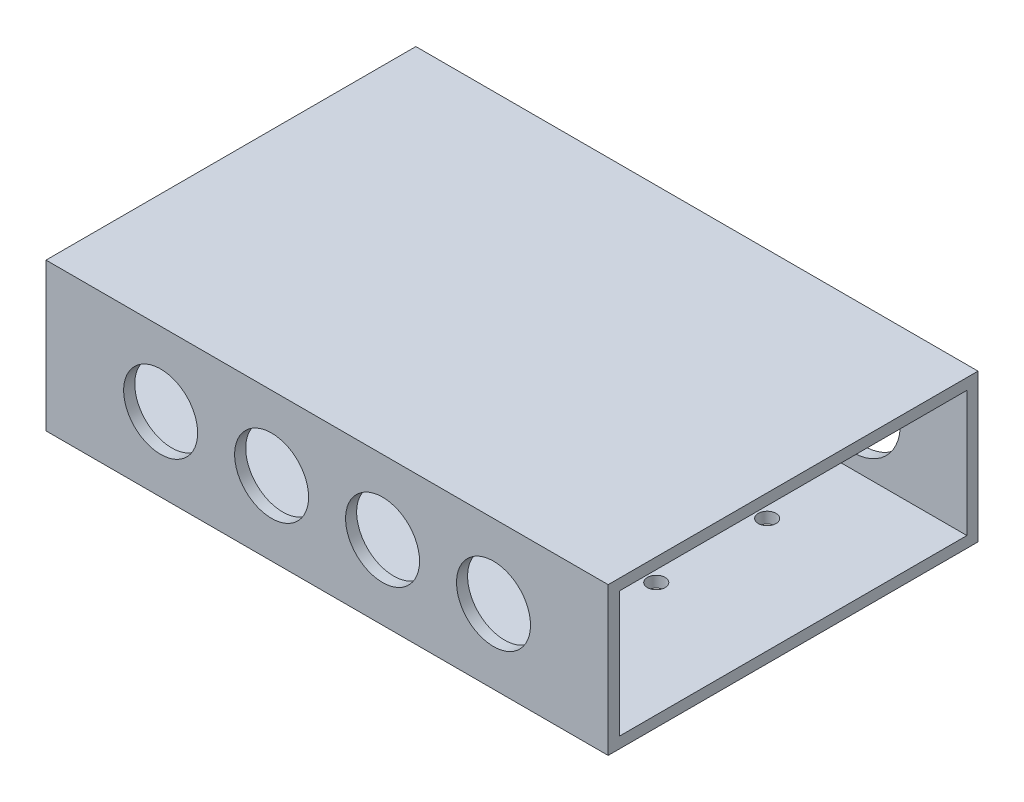
ISO-10303-21;
HEADER;
FILE_DESCRIPTION(('STEP AP214'),'2;1');
FILE_NAME('part.step','',(''),(''),'','','');
FILE_SCHEMA(('AUTOMOTIVE_DESIGN { 1 0 10303 214 1 1 1 1 }'));
ENDSEC;
DATA;
#1=APPLICATION_CONTEXT('core data for automotive mechanical design processes');
#2=APPLICATION_PROTOCOL_DEFINITION('international standard','automotive_design',2000,#1);
#3=PRODUCT_CONTEXT('',#1,'mechanical');
#4=PRODUCT('Part','Part','',(#3));
#5=PRODUCT_RELATED_PRODUCT_CATEGORY('part','',(#4));
#6=PRODUCT_DEFINITION_FORMATION('','',#4);
#7=PRODUCT_DEFINITION_CONTEXT('part definition',#1,'design');
#8=PRODUCT_DEFINITION('design','',#6,#7);
#9=PRODUCT_DEFINITION_SHAPE('','',#8);
#10=(LENGTH_UNIT() NAMED_UNIT(*) SI_UNIT(.MILLI.,.METRE.));
#11=(NAMED_UNIT(*) PLANE_ANGLE_UNIT() SI_UNIT($,.RADIAN.));
#12=(NAMED_UNIT(*) SI_UNIT($,.STERADIAN.) SOLID_ANGLE_UNIT());
#13=UNCERTAINTY_MEASURE_WITH_UNIT(LENGTH_MEASURE(1.E-05),#10,'distance_accuracy_value','');
#14=(GEOMETRIC_REPRESENTATION_CONTEXT(3) GLOBAL_UNCERTAINTY_ASSIGNED_CONTEXT((#13)) GLOBAL_UNIT_ASSIGNED_CONTEXT((#10,
#11,#12)) REPRESENTATION_CONTEXT('',''));
#15=CARTESIAN_POINT('',(0.,0.,0.));
#16=DIRECTION('',(0.,0.,1.));
#17=DIRECTION('',(1.,0.,0.));
#18=AXIS2_PLACEMENT_3D('',#15,#16,#17);
#19=CARTESIAN_POINT('',(-26.4703464471914,20.,-33.7508764383577));
#20=DIRECTION('',(1.,0.,0.));
#21=DIRECTION('',(0.,0.,-1.));
#22=AXIS2_PLACEMENT_3D('',#19,#20,#21);
#23=PLANE('',#22);
#24=DIRECTION('',(0.,0.,-1.));
#25=VECTOR('',#24,1.);
#26=CARTESIAN_POINT('',(-26.4703464471914,18.5,14.7491235616423));
#27=LINE('',#26,#25);
#28=CARTESIAN_POINT('',(-26.4703464471914,18.5,14.7491235616423));
#29=VERTEX_POINT('',#28);
#30=CARTESIAN_POINT('',(-26.4703464471914,18.5,-32.2508764383577));
#31=VERTEX_POINT('',#30);
#32=EDGE_CURVE('E129',#29,#31,#27,.T.);
#33=ORIENTED_EDGE('',*,*,#32,.F.);
#34=DIRECTION('',(0.,1.,0.));
#35=VECTOR('',#34,1.);
#36=CARTESIAN_POINT('',(-26.4703464471914,1.5,14.7491235616423));
#37=LINE('',#36,#35);
#38=CARTESIAN_POINT('',(-26.4703464471914,1.5,14.7491235616423));
#39=VERTEX_POINT('',#38);
#40=EDGE_CURVE('E49',#39,#29,#37,.T.);
#41=ORIENTED_EDGE('',*,*,#40,.F.);
#42=DIRECTION('',(0.,0.,1.));
#43=VECTOR('',#42,1.);
#44=CARTESIAN_POINT('',(-26.4703464471914,1.5,14.7491235616423));
#45=LINE('',#44,#43);
#46=CARTESIAN_POINT('',(-26.4703464471914,1.49999999999999,-32.2508764383577));
#47=VERTEX_POINT('',#46);
#48=EDGE_CURVE('E117',#47,#39,#45,.T.);
#49=ORIENTED_EDGE('',*,*,#48,.F.);
#50=DIRECTION('',(0.,-1.,0.));
#51=VECTOR('',#50,1.);
#52=CARTESIAN_POINT('',(-26.4703464471914,1.49999999999999,-32.2508764383577));
#53=LINE('',#52,#51);
#54=EDGE_CURVE('E120',#31,#47,#53,.T.);
#55=ORIENTED_EDGE('',*,*,#54,.F.);
#56=EDGE_LOOP('',(#33,#41,#49,#55));
#57=FACE_BOUND('',#56,.T.);
#58=DIRECTION('',(0.,0.,1.));
#59=VECTOR('',#58,1.);
#60=CARTESIAN_POINT('',(-26.4703464471914,0.,-33.7508764383577));
#61=LINE('',#60,#59);
#62=CARTESIAN_POINT('',(-26.4703464471914,0.,-33.7508764383577));
#63=VERTEX_POINT('',#62);
#64=CARTESIAN_POINT('',(-26.4703464471914,0.,16.2491235616423));
#65=VERTEX_POINT('',#64);
#66=EDGE_CURVE('E136',#63,#65,#61,.T.);
#67=ORIENTED_EDGE('',*,*,#66,.T.);
#68=DIRECTION('',(0.,-1.,0.));
#69=VECTOR('',#68,1.);
#70=CARTESIAN_POINT('',(-26.4703464471914,20.,16.2491235616423));
#71=LINE('',#70,#69);
#72=CARTESIAN_POINT('',(-26.4703464471914,20.,16.2491235616423));
#73=VERTEX_POINT('',#72);
#74=EDGE_CURVE('E11',#73,#65,#71,.T.);
#75=ORIENTED_EDGE('',*,*,#74,.F.);
#76=DIRECTION('',(0.,0.,1.));
#77=VECTOR('',#76,1.);
#78=CARTESIAN_POINT('',(-26.4703464471914,20.,-33.7508764383577));
#79=LINE('',#78,#77);
#80=CARTESIAN_POINT('',(-26.4703464471914,20.,-33.7508764383577));
#81=VERTEX_POINT('',#80);
#82=EDGE_CURVE('E140',#81,#73,#79,.T.);
#83=ORIENTED_EDGE('',*,*,#82,.F.);
#84=DIRECTION('',(0.,-1.,0.));
#85=VECTOR('',#84,1.);
#86=CARTESIAN_POINT('',(-26.4703464471914,20.,-33.7508764383577));
#87=LINE('',#86,#85);
#88=EDGE_CURVE('E150',#81,#63,#87,.T.);
#89=ORIENTED_EDGE('',*,*,#88,.T.);
#90=EDGE_LOOP('',(#67,#75,#83,#89));
#91=FACE_BOUND('',#90,.T.);
#92=ADVANCED_FACE('F33',(#57,#91),#23,.F.);
#93=CARTESIAN_POINT('',(-26.4703464471914,20.,16.2491235616423));
#94=DIRECTION('',(0.,0.,-1.));
#95=DIRECTION('',(-1.,0.,0.));
#96=AXIS2_PLACEMENT_3D('',#93,#94,#95);
#97=PLANE('',#96);
#98=CARTESIAN_POINT('',(34.0296535528086,10.,16.2491235616423));
#99=DIRECTION('',(0.,0.,1.));
#100=DIRECTION('',(1.,0.,0.));
#101=AXIS2_PLACEMENT_3D('',#98,#99,#100);
#102=CIRCLE('',#101,5.);
#103=CARTESIAN_POINT('',(39.0296535528086,10.,16.2491235616423));
#104=VERTEX_POINT('',#103);
#105=EDGE_CURVE('E194',#104,#104,#102,.T.);
#106=ORIENTED_EDGE('',*,*,#105,.F.);
#107=EDGE_LOOP('',(#106));
#108=FACE_BOUND('',#107,.T.);
#109=CARTESIAN_POINT('',(19.0296535528086,10.,16.2491235616423));
#110=DIRECTION('',(0.,0.,1.));
#111=DIRECTION('',(1.,0.,0.));
#112=AXIS2_PLACEMENT_3D('',#109,#110,#111);
#113=CIRCLE('',#112,5.);
#114=CARTESIAN_POINT('',(24.0296535528086,10.,16.2491235616423));
#115=VERTEX_POINT('',#114);
#116=EDGE_CURVE('E190',#115,#115,#113,.T.);
#117=ORIENTED_EDGE('',*,*,#116,.F.);
#118=EDGE_LOOP('',(#117));
#119=FACE_BOUND('',#118,.T.);
#120=CARTESIAN_POINT('',(4.02965355280857,10.,16.2491235616423));
#121=DIRECTION('',(0.,0.,1.));
#122=DIRECTION('',(1.,0.,0.));
#123=AXIS2_PLACEMENT_3D('',#120,#121,#122);
#124=CIRCLE('',#123,5.);
#125=CARTESIAN_POINT('',(9.02965355280857,10.,16.2491235616423));
#126=VERTEX_POINT('',#125);
#127=EDGE_CURVE('E186',#126,#126,#124,.T.);
#128=ORIENTED_EDGE('',*,*,#127,.F.);
#129=EDGE_LOOP('',(#128));
#130=FACE_BOUND('',#129,.T.);
#131=CARTESIAN_POINT('',(-10.9703464471914,10.,16.2491235616423));
#132=DIRECTION('',(0.,0.,1.));
#133=DIRECTION('',(1.,0.,0.));
#134=AXIS2_PLACEMENT_3D('',#131,#132,#133);
#135=CIRCLE('',#134,5.);
#136=CARTESIAN_POINT('',(-5.97034644719143,10.,16.2491235616423));
#137=VERTEX_POINT('',#136);
#138=EDGE_CURVE('E182',#137,#137,#135,.T.);
#139=ORIENTED_EDGE('',*,*,#138,.F.);
#140=EDGE_LOOP('',(#139));
#141=FACE_BOUND('',#140,.T.);
#142=DIRECTION('',(1.,0.,0.));
#143=VECTOR('',#142,1.);
#144=CARTESIAN_POINT('',(-26.4703464471914,0.,16.2491235616423));
#145=LINE('',#144,#143);
#146=CARTESIAN_POINT('',(49.5296535528086,0.,16.2491235616423));
#147=VERTEX_POINT('',#146);
#148=EDGE_CURVE('E153',#65,#147,#145,.T.);
#149=ORIENTED_EDGE('',*,*,#148,.T.);
#150=DIRECTION('',(0.,-1.,0.));
#151=VECTOR('',#150,1.);
#152=CARTESIAN_POINT('',(49.5296535528086,20.,16.2491235616423));
#153=LINE('',#152,#151);
#154=CARTESIAN_POINT('',(49.5296535528086,20.,16.2491235616423));
#155=VERTEX_POINT('',#154);
#156=EDGE_CURVE('E41',#155,#147,#153,.T.);
#157=ORIENTED_EDGE('',*,*,#156,.F.);
#158=DIRECTION('',(1.,0.,0.));
#159=VECTOR('',#158,1.);
#160=CARTESIAN_POINT('',(-26.4703464471914,20.,16.2491235616423));
#161=LINE('',#160,#159);
#162=EDGE_CURVE('E143',#73,#155,#161,.T.);
#163=ORIENTED_EDGE('',*,*,#162,.F.);
#164=ORIENTED_EDGE('',*,*,#74,.T.);
#165=EDGE_LOOP('',(#149,#157,#163,#164));
#166=FACE_BOUND('',#165,.T.);
#167=ADVANCED_FACE('F282',(#108,#119,#130,#141,#166),#97,.F.);
#168=CARTESIAN_POINT('',(49.5296535528086,20.,-33.7508764383577));
#169=DIRECTION('',(-1.,0.,0.));
#170=DIRECTION('',(0.,0.,1.));
#171=AXIS2_PLACEMENT_3D('',#168,#169,#170);
#172=PLANE('',#171);
#173=DIRECTION('',(0.,0.,1.));
#174=VECTOR('',#173,1.);
#175=CARTESIAN_POINT('',(49.5296535528086,1.5,14.7491235616423));
#176=LINE('',#175,#174);
#177=CARTESIAN_POINT('',(49.5296535528086,1.49999999999999,-32.2508764383577));
#178=VERTEX_POINT('',#177);
#179=CARTESIAN_POINT('',(49.5296535528086,1.5,14.7491235616423));
#180=VERTEX_POINT('',#179);
#181=EDGE_CURVE('E107',#178,#180,#176,.T.);
#182=ORIENTED_EDGE('',*,*,#181,.T.);
#183=DIRECTION('',(0.,1.,0.));
#184=VECTOR('',#183,1.);
#185=CARTESIAN_POINT('',(49.5296535528086,1.5,14.7491235616423));
#186=LINE('',#185,#184);
#187=CARTESIAN_POINT('',(49.5296535528086,18.5,14.7491235616423));
#188=VERTEX_POINT('',#187);
#189=EDGE_CURVE('E101',#180,#188,#186,.T.);
#190=ORIENTED_EDGE('',*,*,#189,.T.);
#191=DIRECTION('',(0.,0.,-1.));
#192=VECTOR('',#191,1.);
#193=CARTESIAN_POINT('',(49.5296535528086,18.5,14.7491235616423));
#194=LINE('',#193,#192);
#195=CARTESIAN_POINT('',(49.5296535528086,18.5,-32.2508764383577));
#196=VERTEX_POINT('',#195);
#197=EDGE_CURVE('E110',#188,#196,#194,.T.);
#198=ORIENTED_EDGE('',*,*,#197,.T.);
#199=DIRECTION('',(0.,-1.,0.));
#200=VECTOR('',#199,1.);
#201=CARTESIAN_POINT('',(49.5296535528086,1.49999999999999,-32.2508764383577));
#202=LINE('',#201,#200);
#203=EDGE_CURVE('E57',#196,#178,#202,.T.);
#204=ORIENTED_EDGE('',*,*,#203,.T.);
#205=EDGE_LOOP('',(#182,#190,#198,#204));
#206=FACE_BOUND('',#205,.T.);
#207=DIRECTION('',(0.,0.,-1.));
#208=VECTOR('',#207,1.);
#209=CARTESIAN_POINT('',(49.5296535528086,0.,-33.7508764383577));
#210=LINE('',#209,#208);
#211=CARTESIAN_POINT('',(49.5296535528086,0.,-33.7508764383577));
#212=VERTEX_POINT('',#211);
#213=EDGE_CURVE('E155',#147,#212,#210,.T.);
#214=ORIENTED_EDGE('',*,*,#213,.T.);
#215=DIRECTION('',(0.,-1.,0.));
#216=VECTOR('',#215,1.);
#217=CARTESIAN_POINT('',(49.5296535528086,20.,-33.7508764383577));
#218=LINE('',#217,#216);
#219=CARTESIAN_POINT('',(49.5296535528086,20.,-33.7508764383577));
#220=VERTEX_POINT('',#219);
#221=EDGE_CURVE('E160',#220,#212,#218,.T.);
#222=ORIENTED_EDGE('',*,*,#221,.F.);
#223=DIRECTION('',(0.,0.,-1.));
#224=VECTOR('',#223,1.);
#225=CARTESIAN_POINT('',(49.5296535528086,20.,-33.7508764383577));
#226=LINE('',#225,#224);
#227=EDGE_CURVE('E146',#155,#220,#226,.T.);
#228=ORIENTED_EDGE('',*,*,#227,.F.);
#229=ORIENTED_EDGE('',*,*,#156,.T.);
#230=EDGE_LOOP('',(#214,#222,#228,#229));
#231=FACE_BOUND('',#230,.T.);
#232=ADVANCED_FACE('F114',(#206,#231),#172,.F.);
#233=CARTESIAN_POINT('',(-26.4703464471914,20.,-33.7508764383577));
#234=DIRECTION('',(0.,0.,1.));
#235=DIRECTION('',(1.,0.,0.));
#236=AXIS2_PLACEMENT_3D('',#233,#234,#235);
#237=PLANE('',#236);
#238=CARTESIAN_POINT('',(34.0296535528086,9.99999999999969,-33.7508764383577));
#239=DIRECTION('',(0.,0.,-1.));
#240=DIRECTION('',(-1.,0.,0.));
#241=AXIS2_PLACEMENT_3D('',#238,#239,#240);
#242=CIRCLE('',#241,6.5);
#243=CARTESIAN_POINT('',(27.5296535528086,9.99999999999969,-33.7508764383577));
#244=VERTEX_POINT('',#243);
#245=EDGE_CURVE('E178',#244,#244,#242,.T.);
#246=ORIENTED_EDGE('',*,*,#245,.F.);
#247=EDGE_LOOP('',(#246));
#248=FACE_BOUND('',#247,.T.);
#249=CARTESIAN_POINT('',(19.0296535528086,9.99999999999979,-33.7508764383577));
#250=DIRECTION('',(0.,0.,-1.));
#251=DIRECTION('',(-1.,0.,0.));
#252=AXIS2_PLACEMENT_3D('',#249,#250,#251);
#253=CIRCLE('',#252,6.5);
#254=CARTESIAN_POINT('',(12.5296535528086,9.99999999999979,-33.7508764383577));
#255=VERTEX_POINT('',#254);
#256=EDGE_CURVE('E174',#255,#255,#253,.T.);
#257=ORIENTED_EDGE('',*,*,#256,.F.);
#258=EDGE_LOOP('',(#257));
#259=FACE_BOUND('',#258,.T.);
#260=CARTESIAN_POINT('',(4.02965355280856,9.9999999999999,-33.7508764383577));
#261=DIRECTION('',(0.,0.,-1.));
#262=DIRECTION('',(-1.,0.,0.));
#263=AXIS2_PLACEMENT_3D('',#260,#261,#262);
#264=CIRCLE('',#263,6.5);
#265=CARTESIAN_POINT('',(-2.47034644719144,9.9999999999999,-33.7508764383577));
#266=VERTEX_POINT('',#265);
#267=EDGE_CURVE('E170',#266,#266,#264,.T.);
#268=ORIENTED_EDGE('',*,*,#267,.F.);
#269=EDGE_LOOP('',(#268));
#270=FACE_BOUND('',#269,.T.);
#271=CARTESIAN_POINT('',(-10.9703464471914,10.,-33.7508764383577));
#272=DIRECTION('',(0.,0.,-1.));
#273=DIRECTION('',(-1.,0.,0.));
#274=AXIS2_PLACEMENT_3D('',#271,#272,#273);
#275=CIRCLE('',#274,6.5);
#276=CARTESIAN_POINT('',(-17.4703464471914,10.,-33.7508764383577));
#277=VERTEX_POINT('',#276);
#278=EDGE_CURVE('E123',#277,#277,#275,.T.);
#279=ORIENTED_EDGE('',*,*,#278,.F.);
#280=EDGE_LOOP('',(#279));
#281=FACE_BOUND('',#280,.T.);
#282=DIRECTION('',(-1.,0.,0.));
#283=VECTOR('',#282,1.);
#284=CARTESIAN_POINT('',(-26.4703464471914,0.,-33.7508764383577));
#285=LINE('',#284,#283);
#286=EDGE_CURVE('E144',#212,#63,#285,.T.);
#287=ORIENTED_EDGE('',*,*,#286,.T.);
#288=ORIENTED_EDGE('',*,*,#88,.F.);
#289=DIRECTION('',(-1.,0.,0.));
#290=VECTOR('',#289,1.);
#291=CARTESIAN_POINT('',(-26.4703464471914,20.,-33.7508764383577));
#292=LINE('',#291,#290);
#293=EDGE_CURVE('E148',#220,#81,#292,.T.);
#294=ORIENTED_EDGE('',*,*,#293,.F.);
#295=ORIENTED_EDGE('',*,*,#221,.T.);
#296=EDGE_LOOP('',(#287,#288,#294,#295));
#297=FACE_BOUND('',#296,.T.);
#298=ADVANCED_FACE('F260',(#248,#259,#270,#281,#297),#237,.F.);
#299=CARTESIAN_POINT('',(0.,20.,0.));
#300=DIRECTION('',(0.,1.,0.));
#301=DIRECTION('',(0.,0.,1.));
#302=AXIS2_PLACEMENT_3D('',#299,#300,#301);
#303=PLANE('',#302);
#304=ORIENTED_EDGE('',*,*,#82,.T.);
#305=ORIENTED_EDGE('',*,*,#162,.T.);
#306=ORIENTED_EDGE('',*,*,#227,.T.);
#307=ORIENTED_EDGE('',*,*,#293,.T.);
#308=EDGE_LOOP('',(#304,#305,#306,#307));
#309=FACE_BOUND('',#308,.T.);
#310=ADVANCED_FACE('F263',(#309),#303,.T.);
#311=CARTESIAN_POINT('',(0.,0.,0.));
#312=DIRECTION('',(0.,1.,0.));
#313=DIRECTION('',(0.,0.,1.));
#314=AXIS2_PLACEMENT_3D('',#311,#312,#313);
#315=PLANE('',#314);
#316=CARTESIAN_POINT('',(34.0296535528084,0.,-5.75087643835774));
#317=DIRECTION('',(0.,-1.,0.));
#318=DIRECTION('',(0.,0.,-1.));
#319=AXIS2_PLACEMENT_3D('',#316,#317,#318);
#320=CIRCLE('',#319,1.2);
#321=CARTESIAN_POINT('',(34.0296535528084,0.,-6.95087643835774));
#322=VERTEX_POINT('',#321);
#323=EDGE_CURVE('E230',#322,#322,#320,.T.);
#324=ORIENTED_EDGE('',*,*,#323,.F.);
#325=EDGE_LOOP('',(#324));
#326=FACE_BOUND('',#325,.T.);
#327=CARTESIAN_POINT('',(-10.9703464471916,0.,-5.75087643835774));
#328=DIRECTION('',(0.,-1.,0.));
#329=DIRECTION('',(0.,0.,-1.));
#330=AXIS2_PLACEMENT_3D('',#327,#328,#329);
#331=CIRCLE('',#330,1.2);
#332=CARTESIAN_POINT('',(-10.9703464471916,0.,-6.95087643835774));
#333=VERTEX_POINT('',#332);
#334=EDGE_CURVE('E220',#333,#333,#331,.T.);
#335=ORIENTED_EDGE('',*,*,#334,.F.);
#336=EDGE_LOOP('',(#335));
#337=FACE_BOUND('',#336,.T.);
#338=CARTESIAN_POINT('',(4.02965355280841,0.,-5.75087643835774));
#339=DIRECTION('',(0.,-1.,0.));
#340=DIRECTION('',(0.,0.,-1.));
#341=AXIS2_PLACEMENT_3D('',#338,#339,#340);
#342=CIRCLE('',#341,1.2);
#343=CARTESIAN_POINT('',(4.02965355280841,0.,-6.95087643835774));
#344=VERTEX_POINT('',#343);
#345=EDGE_CURVE('E217',#344,#344,#342,.T.);
#346=ORIENTED_EDGE('',*,*,#345,.F.);
#347=EDGE_LOOP('',(#346));
#348=FACE_BOUND('',#347,.T.);
#349=CARTESIAN_POINT('',(19.0296535528084,0.,-5.75087643835774));
#350=DIRECTION('',(0.,-1.,0.));
#351=DIRECTION('',(0.,0.,-1.));
#352=AXIS2_PLACEMENT_3D('',#349,#350,#351);
#353=CIRCLE('',#352,1.2);
#354=CARTESIAN_POINT('',(19.0296535528084,0.,-6.95087643835774));
#355=VERTEX_POINT('',#354);
#356=EDGE_CURVE('E214',#355,#355,#353,.T.);
#357=ORIENTED_EDGE('',*,*,#356,.F.);
#358=EDGE_LOOP('',(#357));
#359=FACE_BOUND('',#358,.T.);
#360=CARTESIAN_POINT('',(-10.9703464471914,0.,-20.7508764383577));
#361=DIRECTION('',(0.,-1.,0.));
#362=DIRECTION('',(0.,0.,-1.));
#363=AXIS2_PLACEMENT_3D('',#360,#361,#362);
#364=CIRCLE('',#363,1.2);
#365=CARTESIAN_POINT('',(-10.9703464471914,0.,-21.9508764383577));
#366=VERTEX_POINT('',#365);
#367=EDGE_CURVE('E210',#366,#366,#364,.T.);
#368=ORIENTED_EDGE('',*,*,#367,.F.);
#369=EDGE_LOOP('',(#368));
#370=FACE_BOUND('',#369,.T.);
#371=CARTESIAN_POINT('',(4.02965355280857,0.,-20.7508764383577));
#372=DIRECTION('',(0.,-1.,0.));
#373=DIRECTION('',(0.,0.,-1.));
#374=AXIS2_PLACEMENT_3D('',#371,#372,#373);
#375=CIRCLE('',#374,1.2);
#376=CARTESIAN_POINT('',(4.02965355280857,0.,-21.9508764383577));
#377=VERTEX_POINT('',#376);
#378=EDGE_CURVE('E206',#377,#377,#375,.T.);
#379=ORIENTED_EDGE('',*,*,#378,.F.);
#380=EDGE_LOOP('',(#379));
#381=FACE_BOUND('',#380,.T.);
#382=CARTESIAN_POINT('',(19.0296535528086,0.,-20.7508764383577));
#383=DIRECTION('',(0.,-1.,0.));
#384=DIRECTION('',(0.,0.,-1.));
#385=AXIS2_PLACEMENT_3D('',#382,#383,#384);
#386=CIRCLE('',#385,1.2);
#387=CARTESIAN_POINT('',(19.0296535528086,0.,-21.9508764383577));
#388=VERTEX_POINT('',#387);
#389=EDGE_CURVE('E202',#388,#388,#386,.T.);
#390=ORIENTED_EDGE('',*,*,#389,.F.);
#391=EDGE_LOOP('',(#390));
#392=FACE_BOUND('',#391,.T.);
#393=CARTESIAN_POINT('',(34.0296535528086,0.,-20.7508764383577));
#394=DIRECTION('',(0.,-1.,0.));
#395=DIRECTION('',(0.,0.,-1.));
#396=AXIS2_PLACEMENT_3D('',#393,#394,#395);
#397=CIRCLE('',#396,1.2);
#398=CARTESIAN_POINT('',(34.0296535528086,0.,-21.9508764383577));
#399=VERTEX_POINT('',#398);
#400=EDGE_CURVE('E198',#399,#399,#397,.T.);
#401=ORIENTED_EDGE('',*,*,#400,.F.);
#402=EDGE_LOOP('',(#401));
#403=FACE_BOUND('',#402,.T.);
#404=ORIENTED_EDGE('',*,*,#66,.F.);
#405=ORIENTED_EDGE('',*,*,#286,.F.);
#406=ORIENTED_EDGE('',*,*,#213,.F.);
#407=ORIENTED_EDGE('',*,*,#148,.F.);
#408=EDGE_LOOP('',(#404,#405,#406,#407));
#409=FACE_BOUND('',#408,.T.);
#410=ADVANCED_FACE('F279',(#326,#337,#348,#359,#370,#381,#392,#403,#409),#315,.F.);
#411=CARTESIAN_POINT('',(49.5296535528086,1.5,14.7491235616423));
#412=DIRECTION('',(0.,0.,1.));
#413=DIRECTION('',(1.,0.,0.));
#414=AXIS2_PLACEMENT_3D('',#411,#412,#413);
#415=PLANE('',#414);
#416=CARTESIAN_POINT('',(34.0296535528086,10.,14.7491235616423));
#417=DIRECTION('',(0.,0.,1.));
#418=DIRECTION('',(1.,0.,0.));
#419=AXIS2_PLACEMENT_3D('',#416,#417,#418);
#420=CIRCLE('',#419,5.);
#421=CARTESIAN_POINT('',(39.0296535528086,10.,14.7491235616423));
#422=VERTEX_POINT('',#421);
#423=EDGE_CURVE('E191',#422,#422,#420,.T.);
#424=ORIENTED_EDGE('',*,*,#423,.T.);
#425=EDGE_LOOP('',(#424));
#426=FACE_BOUND('',#425,.T.);
#427=CARTESIAN_POINT('',(19.0296535528086,10.,14.7491235616423));
#428=DIRECTION('',(0.,0.,1.));
#429=DIRECTION('',(1.,0.,0.));
#430=AXIS2_PLACEMENT_3D('',#427,#428,#429);
#431=CIRCLE('',#430,5.);
#432=CARTESIAN_POINT('',(24.0296535528086,10.,14.7491235616423));
#433=VERTEX_POINT('',#432);
#434=EDGE_CURVE('E187',#433,#433,#431,.T.);
#435=ORIENTED_EDGE('',*,*,#434,.T.);
#436=EDGE_LOOP('',(#435));
#437=FACE_BOUND('',#436,.T.);
#438=CARTESIAN_POINT('',(4.02965355280857,10.,14.7491235616423));
#439=DIRECTION('',(0.,0.,1.));
#440=DIRECTION('',(1.,0.,0.));
#441=AXIS2_PLACEMENT_3D('',#438,#439,#440);
#442=CIRCLE('',#441,5.);
#443=CARTESIAN_POINT('',(9.02965355280857,10.,14.7491235616423));
#444=VERTEX_POINT('',#443);
#445=EDGE_CURVE('E183',#444,#444,#442,.T.);
#446=ORIENTED_EDGE('',*,*,#445,.T.);
#447=EDGE_LOOP('',(#446));
#448=FACE_BOUND('',#447,.T.);
#449=CARTESIAN_POINT('',(-10.9703464471914,10.,14.7491235616423));
#450=DIRECTION('',(0.,0.,1.));
#451=DIRECTION('',(1.,0.,0.));
#452=AXIS2_PLACEMENT_3D('',#449,#450,#451);
#453=CIRCLE('',#452,5.);
#454=CARTESIAN_POINT('',(-5.97034644719143,10.,14.7491235616423));
#455=VERTEX_POINT('',#454);
#456=EDGE_CURVE('E179',#455,#455,#453,.T.);
#457=ORIENTED_EDGE('',*,*,#456,.T.);
#458=EDGE_LOOP('',(#457));
#459=FACE_BOUND('',#458,.T.);
#460=ORIENTED_EDGE('',*,*,#40,.T.);
#461=DIRECTION('',(-1.,0.,0.));
#462=VECTOR('',#461,1.);
#463=CARTESIAN_POINT('',(49.5296535528086,18.5,14.7491235616423));
#464=LINE('',#463,#462);
#465=EDGE_CURVE('E97',#188,#29,#464,.T.);
#466=ORIENTED_EDGE('',*,*,#465,.F.);
#467=ORIENTED_EDGE('',*,*,#189,.F.);
#468=DIRECTION('',(-1.,0.,0.));
#469=VECTOR('',#468,1.);
#470=CARTESIAN_POINT('',(49.5296535528086,1.5,14.7491235616423));
#471=LINE('',#470,#469);
#472=EDGE_CURVE('E134',#180,#39,#471,.T.);
#473=ORIENTED_EDGE('',*,*,#472,.T.);
#474=EDGE_LOOP('',(#460,#466,#467,#473));
#475=FACE_BOUND('',#474,.T.);
#476=ADVANCED_FACE('F99',(#426,#437,#448,#459,#475),#415,.F.);
#477=CARTESIAN_POINT('',(49.5296535528086,1.5,14.7491235616423));
#478=DIRECTION('',(0.,-1.,0.));
#479=DIRECTION('',(0.,0.,-1.));
#480=AXIS2_PLACEMENT_3D('',#477,#478,#479);
#481=PLANE('',#480);
#482=CARTESIAN_POINT('',(34.0296535528084,1.5,-5.75087643835774));
#483=DIRECTION('',(0.,-1.,0.));
#484=DIRECTION('',(0.,0.,-1.));
#485=AXIS2_PLACEMENT_3D('',#482,#483,#484);
#486=CIRCLE('',#485,1.2);
#487=CARTESIAN_POINT('',(34.0296535528084,1.5,-6.95087643835774));
#488=VERTEX_POINT('',#487);
#489=EDGE_CURVE('E36',#488,#488,#486,.T.);
#490=ORIENTED_EDGE('',*,*,#489,.T.);
#491=EDGE_LOOP('',(#490));
#492=FACE_BOUND('',#491,.T.);
#493=CARTESIAN_POINT('',(-10.9703464471916,1.5,-5.75087643835774));
#494=DIRECTION('',(0.,-1.,0.));
#495=DIRECTION('',(0.,0.,-1.));
#496=AXIS2_PLACEMENT_3D('',#493,#494,#495);
#497=CIRCLE('',#496,1.2);
#498=CARTESIAN_POINT('',(-10.9703464471916,1.5,-6.95087643835774));
#499=VERTEX_POINT('',#498);
#500=EDGE_CURVE('E218',#499,#499,#497,.T.);
#501=ORIENTED_EDGE('',*,*,#500,.T.);
#502=EDGE_LOOP('',(#501));
#503=FACE_BOUND('',#502,.T.);
#504=CARTESIAN_POINT('',(4.02965355280841,1.5,-5.75087643835774));
#505=DIRECTION('',(0.,-1.,0.));
#506=DIRECTION('',(0.,0.,-1.));
#507=AXIS2_PLACEMENT_3D('',#504,#505,#506);
#508=CIRCLE('',#507,1.2);
#509=CARTESIAN_POINT('',(4.02965355280841,1.5,-6.95087643835774));
#510=VERTEX_POINT('',#509);
#511=EDGE_CURVE('E215',#510,#510,#508,.T.);
#512=ORIENTED_EDGE('',*,*,#511,.T.);
#513=EDGE_LOOP('',(#512));
#514=FACE_BOUND('',#513,.T.);
#515=CARTESIAN_POINT('',(19.0296535528084,1.5,-5.75087643835774));
#516=DIRECTION('',(0.,-1.,0.));
#517=DIRECTION('',(0.,0.,-1.));
#518=AXIS2_PLACEMENT_3D('',#515,#516,#517);
#519=CIRCLE('',#518,1.2);
#520=CARTESIAN_POINT('',(19.0296535528084,1.5,-6.95087643835774));
#521=VERTEX_POINT('',#520);
#522=EDGE_CURVE('E211',#521,#521,#519,.T.);
#523=ORIENTED_EDGE('',*,*,#522,.T.);
#524=EDGE_LOOP('',(#523));
#525=FACE_BOUND('',#524,.T.);
#526=CARTESIAN_POINT('',(-10.9703464471914,1.5,-20.7508764383577));
#527=DIRECTION('',(0.,-1.,0.));
#528=DIRECTION('',(0.,0.,-1.));
#529=AXIS2_PLACEMENT_3D('',#526,#527,#528);
#530=CIRCLE('',#529,1.2);
#531=CARTESIAN_POINT('',(-10.9703464471914,1.5,-21.9508764383577));
#532=VERTEX_POINT('',#531);
#533=EDGE_CURVE('E207',#532,#532,#530,.T.);
#534=ORIENTED_EDGE('',*,*,#533,.T.);
#535=EDGE_LOOP('',(#534));
#536=FACE_BOUND('',#535,.T.);
#537=CARTESIAN_POINT('',(4.02965355280857,1.5,-20.7508764383577));
#538=DIRECTION('',(0.,-1.,0.));
#539=DIRECTION('',(0.,0.,-1.));
#540=AXIS2_PLACEMENT_3D('',#537,#538,#539);
#541=CIRCLE('',#540,1.2);
#542=CARTESIAN_POINT('',(4.02965355280857,1.5,-21.9508764383577));
#543=VERTEX_POINT('',#542);
#544=EDGE_CURVE('E203',#543,#543,#541,.T.);
#545=ORIENTED_EDGE('',*,*,#544,.T.);
#546=EDGE_LOOP('',(#545));
#547=FACE_BOUND('',#546,.T.);
#548=CARTESIAN_POINT('',(19.0296535528086,1.5,-20.7508764383577));
#549=DIRECTION('',(0.,-1.,0.));
#550=DIRECTION('',(0.,0.,-1.));
#551=AXIS2_PLACEMENT_3D('',#548,#549,#550);
#552=CIRCLE('',#551,1.2);
#553=CARTESIAN_POINT('',(19.0296535528086,1.5,-21.9508764383577));
#554=VERTEX_POINT('',#553);
#555=EDGE_CURVE('E199',#554,#554,#552,.T.);
#556=ORIENTED_EDGE('',*,*,#555,.T.);
#557=EDGE_LOOP('',(#556));
#558=FACE_BOUND('',#557,.T.);
#559=CARTESIAN_POINT('',(34.0296535528086,1.5,-20.7508764383577));
#560=DIRECTION('',(0.,-1.,0.));
#561=DIRECTION('',(0.,0.,-1.));
#562=AXIS2_PLACEMENT_3D('',#559,#560,#561);
#563=CIRCLE('',#562,1.2);
#564=CARTESIAN_POINT('',(34.0296535528086,1.5,-21.9508764383577));
#565=VERTEX_POINT('',#564);
#566=EDGE_CURVE('E195',#565,#565,#563,.T.);
#567=ORIENTED_EDGE('',*,*,#566,.T.);
#568=EDGE_LOOP('',(#567));
#569=FACE_BOUND('',#568,.T.);
#570=ORIENTED_EDGE('',*,*,#48,.T.);
#571=ORIENTED_EDGE('',*,*,#472,.F.);
#572=ORIENTED_EDGE('',*,*,#181,.F.);
#573=DIRECTION('',(-1.,0.,0.));
#574=VECTOR('',#573,1.);
#575=CARTESIAN_POINT('',(49.5296535528086,1.49999999999999,-32.2508764383577));
#576=LINE('',#575,#574);
#577=EDGE_CURVE('E137',#178,#47,#576,.T.);
#578=ORIENTED_EDGE('',*,*,#577,.T.);
#579=EDGE_LOOP('',(#570,#571,#572,#578));
#580=FACE_BOUND('',#579,.T.);
#581=ADVANCED_FACE('F301',(#492,#503,#514,#525,#536,#547,#558,#569,#580),#481,.F.);
#582=CARTESIAN_POINT('',(49.5296535528086,1.49999999999999,-32.2508764383577));
#583=DIRECTION('',(0.,0.,-1.));
#584=DIRECTION('',(-1.,0.,0.));
#585=AXIS2_PLACEMENT_3D('',#582,#583,#584);
#586=PLANE('',#585);
#587=CARTESIAN_POINT('',(34.0296535528086,9.99999999999969,-32.2508764383577));
#588=DIRECTION('',(0.,0.,-1.));
#589=DIRECTION('',(-1.,0.,0.));
#590=AXIS2_PLACEMENT_3D('',#587,#588,#589);
#591=CIRCLE('',#590,6.5);
#592=CARTESIAN_POINT('',(27.5296535528086,9.99999999999969,-32.2508764383577));
#593=VERTEX_POINT('',#592);
#594=EDGE_CURVE('E175',#593,#593,#591,.T.);
#595=ORIENTED_EDGE('',*,*,#594,.T.);
#596=EDGE_LOOP('',(#595));
#597=FACE_BOUND('',#596,.T.);
#598=CARTESIAN_POINT('',(19.0296535528086,9.99999999999979,-32.2508764383577));
#599=DIRECTION('',(0.,0.,-1.));
#600=DIRECTION('',(-1.,0.,0.));
#601=AXIS2_PLACEMENT_3D('',#598,#599,#600);
#602=CIRCLE('',#601,6.5);
#603=CARTESIAN_POINT('',(12.5296535528086,9.99999999999979,-32.2508764383577));
#604=VERTEX_POINT('',#603);
#605=EDGE_CURVE('E171',#604,#604,#602,.T.);
#606=ORIENTED_EDGE('',*,*,#605,.T.);
#607=EDGE_LOOP('',(#606));
#608=FACE_BOUND('',#607,.T.);
#609=CARTESIAN_POINT('',(4.02965355280856,9.9999999999999,-32.2508764383577));
#610=DIRECTION('',(0.,0.,-1.));
#611=DIRECTION('',(-1.,0.,0.));
#612=AXIS2_PLACEMENT_3D('',#609,#610,#611);
#613=CIRCLE('',#612,6.5);
#614=CARTESIAN_POINT('',(-2.47034644719144,9.9999999999999,-32.2508764383577));
#615=VERTEX_POINT('',#614);
#616=EDGE_CURVE('E167',#615,#615,#613,.T.);
#617=ORIENTED_EDGE('',*,*,#616,.T.);
#618=EDGE_LOOP('',(#617));
#619=FACE_BOUND('',#618,.T.);
#620=CARTESIAN_POINT('',(-10.9703464471914,10.,-32.2508764383577));
#621=DIRECTION('',(0.,0.,-1.));
#622=DIRECTION('',(-1.,0.,0.));
#623=AXIS2_PLACEMENT_3D('',#620,#621,#622);
#624=CIRCLE('',#623,6.5);
#625=CARTESIAN_POINT('',(-17.4703464471914,10.,-32.2508764383577));
#626=VERTEX_POINT('',#625);
#627=EDGE_CURVE('E130',#626,#626,#624,.T.);
#628=ORIENTED_EDGE('',*,*,#627,.T.);
#629=EDGE_LOOP('',(#628));
#630=FACE_BOUND('',#629,.T.);
#631=ORIENTED_EDGE('',*,*,#54,.T.);
#632=ORIENTED_EDGE('',*,*,#577,.F.);
#633=ORIENTED_EDGE('',*,*,#203,.F.);
#634=DIRECTION('',(-1.,0.,0.));
#635=VECTOR('',#634,1.);
#636=CARTESIAN_POINT('',(49.5296535528086,18.5,-32.2508764383577));
#637=LINE('',#636,#635);
#638=EDGE_CURVE('E106',#196,#31,#637,.T.);
#639=ORIENTED_EDGE('',*,*,#638,.T.);
#640=EDGE_LOOP('',(#631,#632,#633,#639));
#641=FACE_BOUND('',#640,.T.);
#642=ADVANCED_FACE('F299',(#597,#608,#619,#630,#641),#586,.F.);
#643=CARTESIAN_POINT('',(49.5296535528086,18.5,14.7491235616423));
#644=DIRECTION('',(0.,1.,0.));
#645=DIRECTION('',(0.,0.,1.));
#646=AXIS2_PLACEMENT_3D('',#643,#644,#645);
#647=PLANE('',#646);
#648=ORIENTED_EDGE('',*,*,#32,.T.);
#649=ORIENTED_EDGE('',*,*,#638,.F.);
#650=ORIENTED_EDGE('',*,*,#197,.F.);
#651=ORIENTED_EDGE('',*,*,#465,.T.);
#652=EDGE_LOOP('',(#648,#649,#650,#651));
#653=FACE_BOUND('',#652,.T.);
#654=ADVANCED_FACE('F111',(#653),#647,.F.);
#655=CARTESIAN_POINT('',(-10.9703464471914,10.,-31.7508764383577));
#656=DIRECTION('',(0.,0.,-1.));
#657=DIRECTION('',(-1.,0.,0.));
#658=AXIS2_PLACEMENT_3D('',#655,#656,#657);
#659=CYLINDRICAL_SURFACE('',#658,6.5);
#660=ORIENTED_EDGE('',*,*,#278,.T.);
#661=EDGE_LOOP('',(#660));
#662=FACE_BOUND('',#661,.T.);
#663=ORIENTED_EDGE('',*,*,#627,.F.);
#664=EDGE_LOOP('',(#663));
#665=FACE_BOUND('',#664,.T.);
#666=ADVANCED_FACE('F316',(#662,#665),#659,.F.);
#667=CARTESIAN_POINT('',(4.02965355280856,9.9999999999999,-31.7508764383577));
#668=DIRECTION('',(0.,0.,-1.));
#669=DIRECTION('',(-1.,0.,0.));
#670=AXIS2_PLACEMENT_3D('',#667,#668,#669);
#671=CYLINDRICAL_SURFACE('',#670,6.5);
#672=ORIENTED_EDGE('',*,*,#267,.T.);
#673=EDGE_LOOP('',(#672));
#674=FACE_BOUND('',#673,.T.);
#675=ORIENTED_EDGE('',*,*,#616,.F.);
#676=EDGE_LOOP('',(#675));
#677=FACE_BOUND('',#676,.T.);
#678=ADVANCED_FACE('F257',(#674,#677),#671,.F.);
#679=CARTESIAN_POINT('',(19.0296535528086,9.99999999999979,-31.7508764383577));
#680=DIRECTION('',(0.,0.,-1.));
#681=DIRECTION('',(-1.,0.,0.));
#682=AXIS2_PLACEMENT_3D('',#679,#680,#681);
#683=CYLINDRICAL_SURFACE('',#682,6.5);
#684=ORIENTED_EDGE('',*,*,#256,.T.);
#685=EDGE_LOOP('',(#684));
#686=FACE_BOUND('',#685,.T.);
#687=ORIENTED_EDGE('',*,*,#605,.F.);
#688=EDGE_LOOP('',(#687));
#689=FACE_BOUND('',#688,.T.);
#690=ADVANCED_FACE('F376',(#686,#689),#683,.F.);
#691=CARTESIAN_POINT('',(34.0296535528086,9.99999999999969,-31.7508764383577));
#692=DIRECTION('',(0.,0.,-1.));
#693=DIRECTION('',(-1.,0.,0.));
#694=AXIS2_PLACEMENT_3D('',#691,#692,#693);
#695=CYLINDRICAL_SURFACE('',#694,6.5);
#696=ORIENTED_EDGE('',*,*,#245,.T.);
#697=EDGE_LOOP('',(#696));
#698=FACE_BOUND('',#697,.T.);
#699=ORIENTED_EDGE('',*,*,#594,.F.);
#700=EDGE_LOOP('',(#699));
#701=FACE_BOUND('',#700,.T.);
#702=ADVANCED_FACE('F372',(#698,#701),#695,.F.);
#703=CARTESIAN_POINT('',(-10.9703464471914,10.,14.2491235616423));
#704=DIRECTION('',(0.,0.,1.));
#705=DIRECTION('',(1.,0.,0.));
#706=AXIS2_PLACEMENT_3D('',#703,#704,#705);
#707=CYLINDRICAL_SURFACE('',#706,5.);
#708=ORIENTED_EDGE('',*,*,#138,.T.);
#709=EDGE_LOOP('',(#708));
#710=FACE_BOUND('',#709,.T.);
#711=ORIENTED_EDGE('',*,*,#456,.F.);
#712=EDGE_LOOP('',(#711));
#713=FACE_BOUND('',#712,.T.);
#714=ADVANCED_FACE('F368',(#710,#713),#707,.F.);
#715=CARTESIAN_POINT('',(4.02965355280857,10.,14.2491235616423));
#716=DIRECTION('',(0.,0.,1.));
#717=DIRECTION('',(1.,0.,0.));
#718=AXIS2_PLACEMENT_3D('',#715,#716,#717);
#719=CYLINDRICAL_SURFACE('',#718,5.);
#720=ORIENTED_EDGE('',*,*,#127,.T.);
#721=EDGE_LOOP('',(#720));
#722=FACE_BOUND('',#721,.T.);
#723=ORIENTED_EDGE('',*,*,#445,.F.);
#724=EDGE_LOOP('',(#723));
#725=FACE_BOUND('',#724,.T.);
#726=ADVANCED_FACE('F364',(#722,#725),#719,.F.);
#727=CARTESIAN_POINT('',(19.0296535528086,10.,14.2491235616423));
#728=DIRECTION('',(0.,0.,1.));
#729=DIRECTION('',(1.,0.,0.));
#730=AXIS2_PLACEMENT_3D('',#727,#728,#729);
#731=CYLINDRICAL_SURFACE('',#730,5.);
#732=ORIENTED_EDGE('',*,*,#116,.T.);
#733=EDGE_LOOP('',(#732));
#734=FACE_BOUND('',#733,.T.);
#735=ORIENTED_EDGE('',*,*,#434,.F.);
#736=EDGE_LOOP('',(#735));
#737=FACE_BOUND('',#736,.T.);
#738=ADVANCED_FACE('F357',(#734,#737),#731,.F.);
#739=CARTESIAN_POINT('',(34.0296535528086,10.,14.2491235616423));
#740=DIRECTION('',(0.,0.,1.));
#741=DIRECTION('',(1.,0.,0.));
#742=AXIS2_PLACEMENT_3D('',#739,#740,#741);
#743=CYLINDRICAL_SURFACE('',#742,5.);
#744=ORIENTED_EDGE('',*,*,#105,.T.);
#745=EDGE_LOOP('',(#744));
#746=FACE_BOUND('',#745,.T.);
#747=ORIENTED_EDGE('',*,*,#423,.F.);
#748=EDGE_LOOP('',(#747));
#749=FACE_BOUND('',#748,.T.);
#750=ADVANCED_FACE('F347',(#746,#749),#743,.F.);
#751=CARTESIAN_POINT('',(34.0296535528086,2.,-20.7508764383577));
#752=DIRECTION('',(0.,-1.,0.));
#753=DIRECTION('',(0.,0.,-1.));
#754=AXIS2_PLACEMENT_3D('',#751,#752,#753);
#755=CYLINDRICAL_SURFACE('',#754,1.2);
#756=ORIENTED_EDGE('',*,*,#400,.T.);
#757=EDGE_LOOP('',(#756));
#758=FACE_BOUND('',#757,.T.);
#759=ORIENTED_EDGE('',*,*,#566,.F.);
#760=EDGE_LOOP('',(#759));
#761=FACE_BOUND('',#760,.T.);
#762=ADVANCED_FACE('F343',(#758,#761),#755,.F.);
#763=CARTESIAN_POINT('',(19.0296535528086,2.,-20.7508764383577));
#764=DIRECTION('',(0.,-1.,0.));
#765=DIRECTION('',(0.,0.,-1.));
#766=AXIS2_PLACEMENT_3D('',#763,#764,#765);
#767=CYLINDRICAL_SURFACE('',#766,1.2);
#768=ORIENTED_EDGE('',*,*,#389,.T.);
#769=EDGE_LOOP('',(#768));
#770=FACE_BOUND('',#769,.T.);
#771=ORIENTED_EDGE('',*,*,#555,.F.);
#772=EDGE_LOOP('',(#771));
#773=FACE_BOUND('',#772,.T.);
#774=ADVANCED_FACE('F346',(#770,#773),#767,.F.);
#775=CARTESIAN_POINT('',(4.02965355280857,2.,-20.7508764383577));
#776=DIRECTION('',(0.,-1.,0.));
#777=DIRECTION('',(0.,0.,-1.));
#778=AXIS2_PLACEMENT_3D('',#775,#776,#777);
#779=CYLINDRICAL_SURFACE('',#778,1.2);
#780=ORIENTED_EDGE('',*,*,#378,.T.);
#781=EDGE_LOOP('',(#780));
#782=FACE_BOUND('',#781,.T.);
#783=ORIENTED_EDGE('',*,*,#544,.F.);
#784=EDGE_LOOP('',(#783));
#785=FACE_BOUND('',#784,.T.);
#786=ADVANCED_FACE('F354',(#782,#785),#779,.F.);
#787=CARTESIAN_POINT('',(-10.9703464471914,2.,-20.7508764383577));
#788=DIRECTION('',(0.,-1.,0.));
#789=DIRECTION('',(0.,0.,-1.));
#790=AXIS2_PLACEMENT_3D('',#787,#788,#789);
#791=CYLINDRICAL_SURFACE('',#790,1.2);
#792=ORIENTED_EDGE('',*,*,#367,.T.);
#793=EDGE_LOOP('',(#792));
#794=FACE_BOUND('',#793,.T.);
#795=ORIENTED_EDGE('',*,*,#533,.F.);
#796=EDGE_LOOP('',(#795));
#797=FACE_BOUND('',#796,.T.);
#798=ADVANCED_FACE('F494',(#794,#797),#791,.F.);
#799=CARTESIAN_POINT('',(19.0296535528084,2.,-5.75087643835774));
#800=DIRECTION('',(0.,-1.,0.));
#801=DIRECTION('',(0.,0.,-1.));
#802=AXIS2_PLACEMENT_3D('',#799,#800,#801);
#803=CYLINDRICAL_SURFACE('',#802,1.2);
#804=ORIENTED_EDGE('',*,*,#356,.T.);
#805=EDGE_LOOP('',(#804));
#806=FACE_BOUND('',#805,.T.);
#807=ORIENTED_EDGE('',*,*,#522,.F.);
#808=EDGE_LOOP('',(#807));
#809=FACE_BOUND('',#808,.T.);
#810=ADVANCED_FACE('F502',(#806,#809),#803,.F.);
#811=CARTESIAN_POINT('',(4.02965355280841,2.,-5.75087643835774));
#812=DIRECTION('',(0.,-1.,0.));
#813=DIRECTION('',(0.,0.,-1.));
#814=AXIS2_PLACEMENT_3D('',#811,#812,#813);
#815=CYLINDRICAL_SURFACE('',#814,1.2);
#816=ORIENTED_EDGE('',*,*,#345,.T.);
#817=EDGE_LOOP('',(#816));
#818=FACE_BOUND('',#817,.T.);
#819=ORIENTED_EDGE('',*,*,#511,.F.);
#820=EDGE_LOOP('',(#819));
#821=FACE_BOUND('',#820,.T.);
#822=ADVANCED_FACE('F511',(#818,#821),#815,.F.);
#823=CARTESIAN_POINT('',(-10.9703464471916,2.,-5.75087643835774));
#824=DIRECTION('',(0.,-1.,0.));
#825=DIRECTION('',(0.,0.,-1.));
#826=AXIS2_PLACEMENT_3D('',#823,#824,#825);
#827=CYLINDRICAL_SURFACE('',#826,1.2);
#828=ORIENTED_EDGE('',*,*,#334,.T.);
#829=EDGE_LOOP('',(#828));
#830=FACE_BOUND('',#829,.T.);
#831=ORIENTED_EDGE('',*,*,#500,.F.);
#832=EDGE_LOOP('',(#831));
#833=FACE_BOUND('',#832,.T.);
#834=ADVANCED_FACE('F520',(#830,#833),#827,.F.);
#835=CARTESIAN_POINT('',(34.0296535528084,2.,-5.75087643835774));
#836=DIRECTION('',(0.,-1.,0.));
#837=DIRECTION('',(0.,0.,-1.));
#838=AXIS2_PLACEMENT_3D('',#835,#836,#837);
#839=CYLINDRICAL_SURFACE('',#838,1.2);
#840=ORIENTED_EDGE('',*,*,#323,.T.);
#841=EDGE_LOOP('',(#840));
#842=FACE_BOUND('',#841,.T.);
#843=ORIENTED_EDGE('',*,*,#489,.F.);
#844=EDGE_LOOP('',(#843));
#845=FACE_BOUND('',#844,.T.);
#846=ADVANCED_FACE('F529',(#842,#845),#839,.F.);
#847=CLOSED_SHELL('',(#92,#167,#232,#298,#310,#410,#476,#581,#642,#654,#666,#678,#690,#702,#714,
#726,#738,#750,#762,#774,#786,#798,#810,#822,#834,#846));
#848=MANIFOLD_SOLID_BREP('B2',#847);
#849=ADVANCED_BREP_SHAPE_REPRESENTATION('',(#18,#848),#14);
#850=SHAPE_DEFINITION_REPRESENTATION(#9,#849);
ENDSEC;
END-ISO-10303-21;
